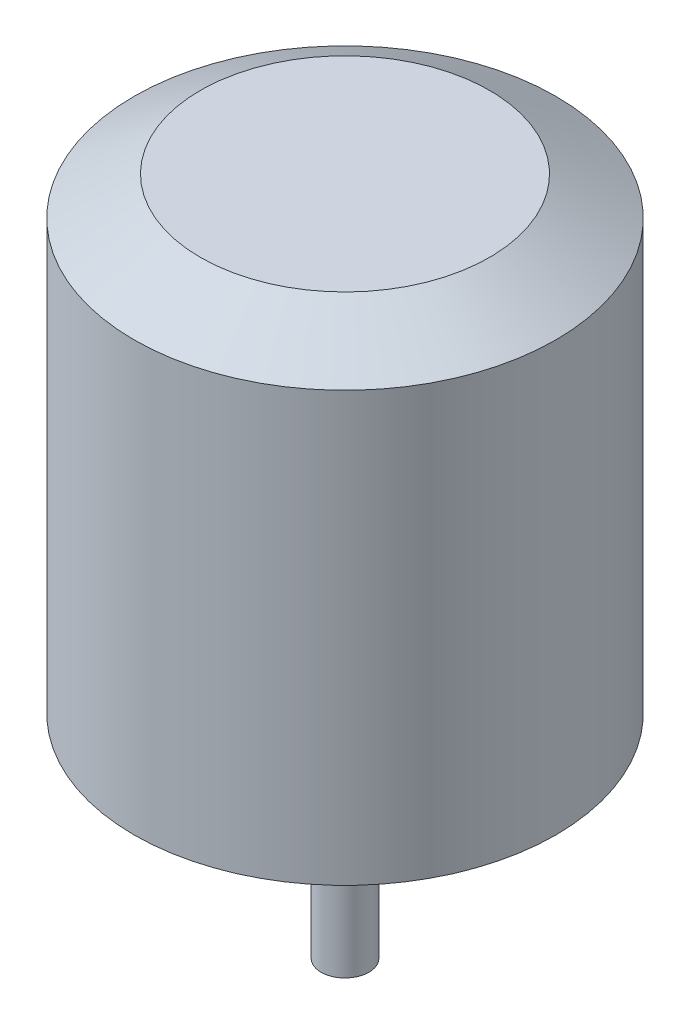
ISO-10303-21;
HEADER;
FILE_DESCRIPTION(('STEP AP214'),'2;1');
FILE_NAME('part.step','',(''),(''),'','','');
FILE_SCHEMA(('AUTOMOTIVE_DESIGN { 1 0 10303 214 1 1 1 1 }'));
ENDSEC;
DATA;
#1=APPLICATION_CONTEXT('core data for automotive mechanical design processes');
#2=APPLICATION_PROTOCOL_DEFINITION('international standard','automotive_design',2000,#1);
#3=PRODUCT_CONTEXT('',#1,'mechanical');
#4=PRODUCT('Part','Part','',(#3));
#5=PRODUCT_RELATED_PRODUCT_CATEGORY('part','',(#4));
#6=PRODUCT_DEFINITION_FORMATION('','',#4);
#7=PRODUCT_DEFINITION_CONTEXT('part definition',#1,'design');
#8=PRODUCT_DEFINITION('design','',#6,#7);
#9=PRODUCT_DEFINITION_SHAPE('','',#8);
#10=(LENGTH_UNIT() NAMED_UNIT(*) SI_UNIT(.MILLI.,.METRE.));
#11=(NAMED_UNIT(*) PLANE_ANGLE_UNIT() SI_UNIT($,.RADIAN.));
#12=(NAMED_UNIT(*) SI_UNIT($,.STERADIAN.) SOLID_ANGLE_UNIT());
#13=UNCERTAINTY_MEASURE_WITH_UNIT(LENGTH_MEASURE(1.E-05),#10,'distance_accuracy_value','');
#14=(GEOMETRIC_REPRESENTATION_CONTEXT(3) GLOBAL_UNCERTAINTY_ASSIGNED_CONTEXT((#13)) GLOBAL_UNIT_ASSIGNED_CONTEXT((#10,
#11,#12)) REPRESENTATION_CONTEXT('',''));
#15=CARTESIAN_POINT('',(0.,0.,0.));
#16=DIRECTION('',(0.,0.,1.));
#17=DIRECTION('',(1.,0.,0.));
#18=AXIS2_PLACEMENT_3D('',#15,#16,#17);
#19=CARTESIAN_POINT('',(0.,15.5,0.));
#20=DIRECTION('',(0.,-1.,0.));
#21=DIRECTION('',(0.,0.,-1.));
#22=AXIS2_PLACEMENT_3D('',#19,#20,#21);
#23=CYLINDRICAL_SURFACE('',#22,14.);
#24=CARTESIAN_POINT('',(0.,12.96,0.));
#25=DIRECTION('',(0.,1.,0.));
#26=DIRECTION('',(0.,0.,1.));
#27=AXIS2_PLACEMENT_3D('',#24,#25,#26);
#28=CIRCLE('',#27,14.);
#29=CARTESIAN_POINT('',(0.,12.96,14.));
#30=VERTEX_POINT('',#29);
#31=EDGE_CURVE('E45',#30,#30,#28,.F.);
#32=ORIENTED_EDGE('',*,*,#31,.T.);
#33=EDGE_LOOP('',(#32));
#34=FACE_BOUND('',#33,.T.);
#35=CARTESIAN_POINT('',(0.,-15.5,0.));
#36=DIRECTION('',(0.,1.,0.));
#37=DIRECTION('',(0.,0.,1.));
#38=AXIS2_PLACEMENT_3D('',#35,#36,#37);
#39=CIRCLE('',#38,14.);
#40=CARTESIAN_POINT('',(0.,-15.5,14.));
#41=VERTEX_POINT('',#40);
#42=EDGE_CURVE('E53',#41,#41,#39,.T.);
#43=ORIENTED_EDGE('',*,*,#42,.T.);
#44=EDGE_LOOP('',(#43));
#45=FACE_BOUND('',#44,.T.);
#46=ADVANCED_FACE('F37',(#34,#45),#23,.T.);
#47=CARTESIAN_POINT('',(0.,15.5,0.));
#48=DIRECTION('',(0.,1.,0.));
#49=DIRECTION('',(0.,0.,1.));
#50=AXIS2_PLACEMENT_3D('',#47,#48,#49);
#51=PLANE('',#50);
#52=CARTESIAN_POINT('',(0.,15.5,0.));
#53=DIRECTION('',(0.,1.,0.));
#54=DIRECTION('',(0.,0.,1.));
#55=AXIS2_PLACEMENT_3D('',#52,#53,#54);
#56=CIRCLE('',#55,9.60059094877506);
#57=CARTESIAN_POINT('',(0.,15.5,9.60059094877506));
#58=VERTEX_POINT('',#57);
#59=EDGE_CURVE('E49',#58,#58,#56,.T.);
#60=ORIENTED_EDGE('',*,*,#59,.T.);
#61=EDGE_LOOP('',(#60));
#62=FACE_BOUND('',#61,.T.);
#63=ADVANCED_FACE('F72',(#62),#51,.T.);
#64=CARTESIAN_POINT('',(0.,-15.5,0.));
#65=DIRECTION('',(0.,1.,0.));
#66=DIRECTION('',(0.,0.,1.));
#67=AXIS2_PLACEMENT_3D('',#64,#65,#66);
#68=PLANE('',#67);
#69=CARTESIAN_POINT('',(0.,-15.5,0.));
#70=DIRECTION('',(0.,1.,0.));
#71=DIRECTION('',(0.,0.,1.));
#72=AXIS2_PLACEMENT_3D('',#69,#70,#71);
#73=CIRCLE('',#72,1.5875);
#74=CARTESIAN_POINT('',(0.,-15.5,1.5875));
#75=VERTEX_POINT('',#74);
#76=EDGE_CURVE('E11',#75,#75,#73,.F.);
#77=ORIENTED_EDGE('',*,*,#76,.F.);
#78=EDGE_LOOP('',(#77));
#79=FACE_BOUND('',#78,.T.);
#80=ORIENTED_EDGE('',*,*,#42,.F.);
#81=EDGE_LOOP('',(#80));
#82=FACE_BOUND('',#81,.T.);
#83=ADVANCED_FACE('F76',(#79,#82),#68,.F.);
#84=CARTESIAN_POINT('',(0.,15.5,0.));
#85=DIRECTION('',(0.,-1.,0.));
#86=DIRECTION('',(0.,0.,-1.));
#87=AXIS2_PLACEMENT_3D('',#84,#85,#86);
#88=CONICAL_SURFACE('',#87,9.60059094877506,1.0471975511966);
#89=ORIENTED_EDGE('',*,*,#31,.F.);
#90=EDGE_LOOP('',(#89));
#91=FACE_BOUND('',#90,.T.);
#92=ORIENTED_EDGE('',*,*,#59,.F.);
#93=EDGE_LOOP('',(#92));
#94=FACE_BOUND('',#93,.T.);
#95=ADVANCED_FACE('F40',(#91,#94),#88,.T.);
#96=CARTESIAN_POINT('',(0.,-79.1901280605346,0.));
#97=DIRECTION('',(0.,1.,0.));
#98=DIRECTION('',(0.,0.,1.));
#99=AXIS2_PLACEMENT_3D('',#96,#97,#98);
#100=CYLINDRICAL_SURFACE('',#99,1.5875);
#101=CARTESIAN_POINT('',(0.,-29.6,0.));
#102=DIRECTION('',(0.,1.,0.));
#103=DIRECTION('',(0.,0.,1.));
#104=AXIS2_PLACEMENT_3D('',#101,#102,#103);
#105=CIRCLE('',#104,1.5875);
#106=CARTESIAN_POINT('',(0.,-29.6,1.5875));
#107=VERTEX_POINT('',#106);
#108=EDGE_CURVE('E58',#107,#107,#105,.T.);
#109=ORIENTED_EDGE('',*,*,#108,.T.);
#110=EDGE_LOOP('',(#109));
#111=FACE_BOUND('',#110,.T.);
#112=ORIENTED_EDGE('',*,*,#76,.T.);
#113=EDGE_LOOP('',(#112));
#114=FACE_BOUND('',#113,.T.);
#115=ADVANCED_FACE('F62',(#111,#114),#100,.T.);
#116=CARTESIAN_POINT('',(0.,-29.6,0.));
#117=DIRECTION('',(0.,1.,0.));
#118=DIRECTION('',(0.,0.,1.));
#119=AXIS2_PLACEMENT_3D('',#116,#117,#118);
#120=PLANE('',#119);
#121=ORIENTED_EDGE('',*,*,#108,.F.);
#122=EDGE_LOOP('',(#121));
#123=FACE_BOUND('',#122,.T.);
#124=ADVANCED_FACE('F64',(#123),#120,.F.);
#125=CLOSED_SHELL('',(#46,#63,#83,#95,#115,#124));
#126=MANIFOLD_SOLID_BREP('B2',#125);
#127=ADVANCED_BREP_SHAPE_REPRESENTATION('',(#18,#126),#14);
#128=SHAPE_DEFINITION_REPRESENTATION(#9,#127);
ENDSEC;
END-ISO-10303-21;
